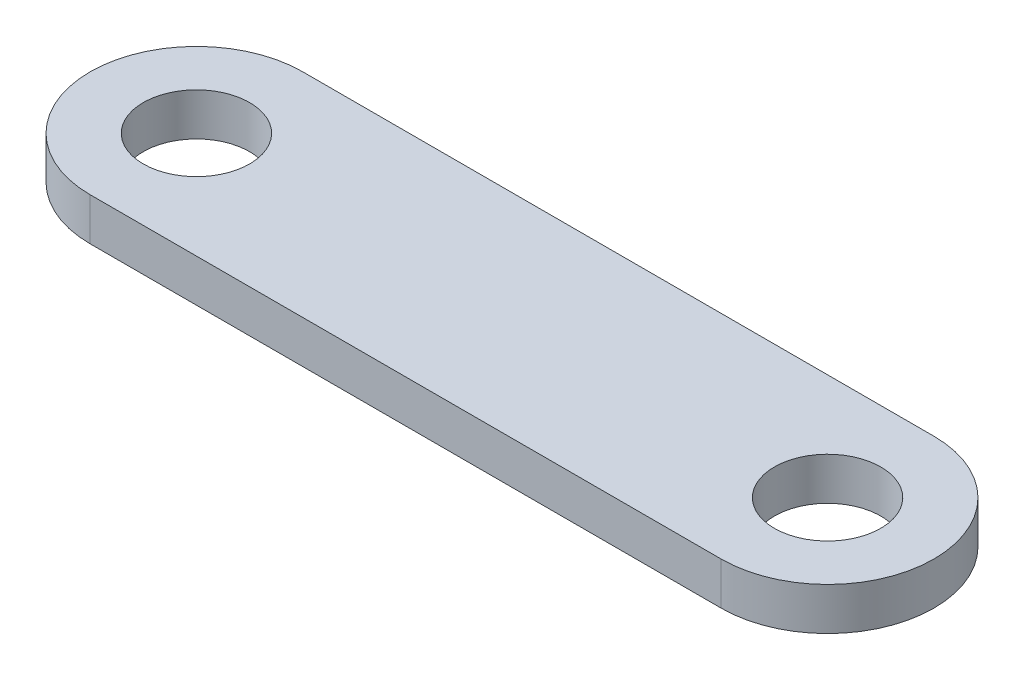
ISO-10303-21;
HEADER;
FILE_DESCRIPTION(('STEP AP214'),'2;1');
FILE_NAME('part.step','',(''),(''),'','','');
FILE_SCHEMA(('AUTOMOTIVE_DESIGN { 1 0 10303 214 1 1 1 1 }'));
ENDSEC;
DATA;
#1=APPLICATION_CONTEXT('core data for automotive mechanical design processes');
#2=APPLICATION_PROTOCOL_DEFINITION('international standard','automotive_design',2000,#1);
#3=PRODUCT_CONTEXT('',#1,'mechanical');
#4=PRODUCT('Part','Part','',(#3));
#5=PRODUCT_RELATED_PRODUCT_CATEGORY('part','',(#4));
#6=PRODUCT_DEFINITION_FORMATION('','',#4);
#7=PRODUCT_DEFINITION_CONTEXT('part definition',#1,'design');
#8=PRODUCT_DEFINITION('design','',#6,#7);
#9=PRODUCT_DEFINITION_SHAPE('','',#8);
#10=(LENGTH_UNIT() NAMED_UNIT(*) SI_UNIT(.MILLI.,.METRE.));
#11=(NAMED_UNIT(*) PLANE_ANGLE_UNIT() SI_UNIT($,.RADIAN.));
#12=(NAMED_UNIT(*) SI_UNIT($,.STERADIAN.) SOLID_ANGLE_UNIT());
#13=UNCERTAINTY_MEASURE_WITH_UNIT(LENGTH_MEASURE(1.E-05),#10,'distance_accuracy_value','');
#14=(GEOMETRIC_REPRESENTATION_CONTEXT(3) GLOBAL_UNCERTAINTY_ASSIGNED_CONTEXT((#13)) GLOBAL_UNIT_ASSIGNED_CONTEXT((#10,
#11,#12)) REPRESENTATION_CONTEXT('',''));
#15=CARTESIAN_POINT('',(0.,0.,0.));
#16=DIRECTION('',(0.,0.,1.));
#17=DIRECTION('',(1.,0.,0.));
#18=AXIS2_PLACEMENT_3D('',#15,#16,#17);
#19=CARTESIAN_POINT('',(-18.837656,2.54,0.));
#20=DIRECTION('',(0.,1.,0.));
#21=DIRECTION('',(0.,0.,1.));
#22=AXIS2_PLACEMENT_3D('',#19,#20,#21);
#23=PLANE('',#22);
#24=CARTESIAN_POINT('',(-18.837656,2.54,0.));
#25=DIRECTION('',(0.,1.,0.));
#26=DIRECTION('',(0.,0.,1.));
#27=AXIS2_PLACEMENT_3D('',#24,#25,#26);
#28=CIRCLE('',#27,3.175);
#29=CARTESIAN_POINT('',(-18.837656,2.54,3.175));
#30=VERTEX_POINT('',#29);
#31=EDGE_CURVE('E103',#30,#30,#28,.T.);
#32=ORIENTED_EDGE('',*,*,#31,.F.);
#33=EDGE_LOOP('',(#32));
#34=FACE_BOUND('',#33,.T.);
#35=CARTESIAN_POINT('',(-18.837656,2.54,0.));
#36=DIRECTION('',(0.,1.,0.));
#37=DIRECTION('',(0.,0.,1.));
#38=AXIS2_PLACEMENT_3D('',#35,#36,#37);
#39=CIRCLE('',#38,6.35);
#40=CARTESIAN_POINT('',(-18.837656,2.54,-6.35));
#41=VERTEX_POINT('',#40);
#42=CARTESIAN_POINT('',(-18.837656,2.54,6.35));
#43=VERTEX_POINT('',#42);
#44=EDGE_CURVE('E88',#41,#43,#39,.T.);
#45=ORIENTED_EDGE('',*,*,#44,.T.);
#46=DIRECTION('',(1.,0.,0.));
#47=VECTOR('',#46,1.);
#48=CARTESIAN_POINT('',(-18.837656,2.54,6.35));
#49=LINE('',#48,#47);
#50=CARTESIAN_POINT('',(18.837656,2.54,6.35));
#51=VERTEX_POINT('',#50);
#52=EDGE_CURVE('E83',#43,#51,#49,.T.);
#53=ORIENTED_EDGE('',*,*,#52,.T.);
#54=CARTESIAN_POINT('',(18.837656,2.54,0.));
#55=DIRECTION('',(0.,1.,0.));
#56=DIRECTION('',(0.,0.,1.));
#57=AXIS2_PLACEMENT_3D('',#54,#55,#56);
#58=CIRCLE('',#57,6.35);
#59=CARTESIAN_POINT('',(18.837656,2.54,-6.35));
#60=VERTEX_POINT('',#59);
#61=EDGE_CURVE('E86',#51,#60,#58,.T.);
#62=ORIENTED_EDGE('',*,*,#61,.T.);
#63=DIRECTION('',(-1.,0.,0.));
#64=VECTOR('',#63,1.);
#65=CARTESIAN_POINT('',(-18.837656,2.54,-6.35));
#66=LINE('',#65,#64);
#67=EDGE_CURVE('E53',#60,#41,#66,.T.);
#68=ORIENTED_EDGE('',*,*,#67,.T.);
#69=EDGE_LOOP('',(#45,#53,#62,#68));
#70=FACE_BOUND('',#69,.T.);
#71=CARTESIAN_POINT('',(18.837656,2.54,0.));
#72=DIRECTION('',(0.,1.,0.));
#73=DIRECTION('',(0.,0.,1.));
#74=AXIS2_PLACEMENT_3D('',#71,#72,#73);
#75=CIRCLE('',#74,3.175);
#76=CARTESIAN_POINT('',(18.837656,2.54,3.175));
#77=VERTEX_POINT('',#76);
#78=EDGE_CURVE('E118',#77,#77,#75,.T.);
#79=ORIENTED_EDGE('',*,*,#78,.F.);
#80=EDGE_LOOP('',(#79));
#81=FACE_BOUND('',#80,.T.);
#82=ADVANCED_FACE('F36',(#34,#70,#81),#23,.T.);
#83=CARTESIAN_POINT('',(-18.837656,0.,0.));
#84=DIRECTION('',(0.,1.,0.));
#85=DIRECTION('',(0.,0.,1.));
#86=AXIS2_PLACEMENT_3D('',#83,#84,#85);
#87=PLANE('',#86);
#88=CARTESIAN_POINT('',(-18.837656,0.,0.));
#89=DIRECTION('',(0.,1.,0.));
#90=DIRECTION('',(0.,0.,1.));
#91=AXIS2_PLACEMENT_3D('',#88,#89,#90);
#92=CIRCLE('',#91,6.35);
#93=CARTESIAN_POINT('',(-18.837656,0.,-6.35));
#94=VERTEX_POINT('',#93);
#95=CARTESIAN_POINT('',(-18.837656,0.,6.35));
#96=VERTEX_POINT('',#95);
#97=EDGE_CURVE('E100',#94,#96,#92,.T.);
#98=ORIENTED_EDGE('',*,*,#97,.F.);
#99=DIRECTION('',(-1.,0.,0.));
#100=VECTOR('',#99,1.);
#101=CARTESIAN_POINT('',(-18.837656,0.,-6.35));
#102=LINE('',#101,#100);
#103=CARTESIAN_POINT('',(18.837656,0.,-6.35));
#104=VERTEX_POINT('',#103);
#105=EDGE_CURVE('E76',#104,#94,#102,.T.);
#106=ORIENTED_EDGE('',*,*,#105,.F.);
#107=CARTESIAN_POINT('',(18.837656,0.,0.));
#108=DIRECTION('',(0.,1.,0.));
#109=DIRECTION('',(0.,0.,1.));
#110=AXIS2_PLACEMENT_3D('',#107,#108,#109);
#111=CIRCLE('',#110,6.35);
#112=CARTESIAN_POINT('',(18.837656,0.,6.35));
#113=VERTEX_POINT('',#112);
#114=EDGE_CURVE('E70',#113,#104,#111,.T.);
#115=ORIENTED_EDGE('',*,*,#114,.F.);
#116=DIRECTION('',(1.,0.,0.));
#117=VECTOR('',#116,1.);
#118=CARTESIAN_POINT('',(-18.837656,0.,6.35));
#119=LINE('',#118,#117);
#120=EDGE_CURVE('E92',#96,#113,#119,.T.);
#121=ORIENTED_EDGE('',*,*,#120,.F.);
#122=EDGE_LOOP('',(#98,#106,#115,#121));
#123=FACE_BOUND('',#122,.T.);
#124=CARTESIAN_POINT('',(-18.837656,0.,0.));
#125=DIRECTION('',(0.,1.,0.));
#126=DIRECTION('',(0.,0.,1.));
#127=AXIS2_PLACEMENT_3D('',#124,#125,#126);
#128=CIRCLE('',#127,3.175);
#129=CARTESIAN_POINT('',(-18.837656,0.,3.175));
#130=VERTEX_POINT('',#129);
#131=EDGE_CURVE('E115',#130,#130,#128,.T.);
#132=ORIENTED_EDGE('',*,*,#131,.T.);
#133=EDGE_LOOP('',(#132));
#134=FACE_BOUND('',#133,.T.);
#135=CARTESIAN_POINT('',(18.837656,0.,0.));
#136=DIRECTION('',(0.,1.,0.));
#137=DIRECTION('',(0.,0.,1.));
#138=AXIS2_PLACEMENT_3D('',#135,#136,#137);
#139=CIRCLE('',#138,3.175);
#140=CARTESIAN_POINT('',(18.837656,0.,3.175));
#141=VERTEX_POINT('',#140);
#142=EDGE_CURVE('E121',#141,#141,#139,.T.);
#143=ORIENTED_EDGE('',*,*,#142,.T.);
#144=EDGE_LOOP('',(#143));
#145=FACE_BOUND('',#144,.T.);
#146=ADVANCED_FACE('F111',(#123,#134,#145),#87,.F.);
#147=CARTESIAN_POINT('',(-18.837656,2.54,0.));
#148=DIRECTION('',(0.,-1.,0.));
#149=DIRECTION('',(0.,0.,-1.));
#150=AXIS2_PLACEMENT_3D('',#147,#148,#149);
#151=CYLINDRICAL_SURFACE('',#150,6.35);
#152=ORIENTED_EDGE('',*,*,#97,.T.);
#153=DIRECTION('',(0.,-1.,0.));
#154=VECTOR('',#153,1.);
#155=CARTESIAN_POINT('',(-18.837656,2.54,6.35));
#156=LINE('',#155,#154);
#157=EDGE_CURVE('E11',#43,#96,#156,.T.);
#158=ORIENTED_EDGE('',*,*,#157,.F.);
#159=ORIENTED_EDGE('',*,*,#44,.F.);
#160=DIRECTION('',(0.,-1.,0.));
#161=VECTOR('',#160,1.);
#162=CARTESIAN_POINT('',(-18.837656,2.54,-6.35));
#163=LINE('',#162,#161);
#164=EDGE_CURVE('E96',#41,#94,#163,.T.);
#165=ORIENTED_EDGE('',*,*,#164,.T.);
#166=EDGE_LOOP('',(#152,#158,#159,#165));
#167=FACE_BOUND('',#166,.T.);
#168=ADVANCED_FACE('F38',(#167),#151,.T.);
#169=CARTESIAN_POINT('',(-18.837656,2.54,6.35));
#170=DIRECTION('',(0.,0.,-1.));
#171=DIRECTION('',(-1.,0.,0.));
#172=AXIS2_PLACEMENT_3D('',#169,#170,#171);
#173=PLANE('',#172);
#174=ORIENTED_EDGE('',*,*,#120,.T.);
#175=DIRECTION('',(0.,-1.,0.));
#176=VECTOR('',#175,1.);
#177=CARTESIAN_POINT('',(18.837656,2.54,6.35));
#178=LINE('',#177,#176);
#179=EDGE_CURVE('E45',#51,#113,#178,.T.);
#180=ORIENTED_EDGE('',*,*,#179,.F.);
#181=ORIENTED_EDGE('',*,*,#52,.F.);
#182=ORIENTED_EDGE('',*,*,#157,.T.);
#183=EDGE_LOOP('',(#174,#180,#181,#182));
#184=FACE_BOUND('',#183,.T.);
#185=ADVANCED_FACE('F91',(#184),#173,.F.);
#186=CARTESIAN_POINT('',(18.837656,2.54,0.));
#187=DIRECTION('',(0.,-1.,0.));
#188=DIRECTION('',(0.,0.,-1.));
#189=AXIS2_PLACEMENT_3D('',#186,#187,#188);
#190=CYLINDRICAL_SURFACE('',#189,6.35);
#191=ORIENTED_EDGE('',*,*,#114,.T.);
#192=DIRECTION('',(0.,-1.,0.));
#193=VECTOR('',#192,1.);
#194=CARTESIAN_POINT('',(18.837656,2.54,-6.35));
#195=LINE('',#194,#193);
#196=EDGE_CURVE('E93',#60,#104,#195,.T.);
#197=ORIENTED_EDGE('',*,*,#196,.F.);
#198=ORIENTED_EDGE('',*,*,#61,.F.);
#199=ORIENTED_EDGE('',*,*,#179,.T.);
#200=EDGE_LOOP('',(#191,#197,#198,#199));
#201=FACE_BOUND('',#200,.T.);
#202=ADVANCED_FACE('F94',(#201),#190,.T.);
#203=CARTESIAN_POINT('',(-18.837656,2.54,-6.35));
#204=DIRECTION('',(0.,0.,1.));
#205=DIRECTION('',(1.,0.,0.));
#206=AXIS2_PLACEMENT_3D('',#203,#204,#205);
#207=PLANE('',#206);
#208=ORIENTED_EDGE('',*,*,#105,.T.);
#209=ORIENTED_EDGE('',*,*,#164,.F.);
#210=ORIENTED_EDGE('',*,*,#67,.F.);
#211=ORIENTED_EDGE('',*,*,#196,.T.);
#212=EDGE_LOOP('',(#208,#209,#210,#211));
#213=FACE_BOUND('',#212,.T.);
#214=ADVANCED_FACE('F108',(#213),#207,.F.);
#215=CARTESIAN_POINT('',(-18.837656,2.54,0.));
#216=DIRECTION('',(0.,-1.,0.));
#217=DIRECTION('',(0.,0.,-1.));
#218=AXIS2_PLACEMENT_3D('',#215,#216,#217);
#219=CYLINDRICAL_SURFACE('',#218,3.175);
#220=ORIENTED_EDGE('',*,*,#31,.T.);
#221=EDGE_LOOP('',(#220));
#222=FACE_BOUND('',#221,.T.);
#223=ORIENTED_EDGE('',*,*,#131,.F.);
#224=EDGE_LOOP('',(#223));
#225=FACE_BOUND('',#224,.T.);
#226=ADVANCED_FACE('F138',(#222,#225),#219,.F.);
#227=CARTESIAN_POINT('',(18.837656,2.54,0.));
#228=DIRECTION('',(0.,-1.,0.));
#229=DIRECTION('',(0.,0.,-1.));
#230=AXIS2_PLACEMENT_3D('',#227,#228,#229);
#231=CYLINDRICAL_SURFACE('',#230,3.175);
#232=ORIENTED_EDGE('',*,*,#78,.T.);
#233=EDGE_LOOP('',(#232));
#234=FACE_BOUND('',#233,.T.);
#235=ORIENTED_EDGE('',*,*,#142,.F.);
#236=EDGE_LOOP('',(#235));
#237=FACE_BOUND('',#236,.T.);
#238=ADVANCED_FACE('F127',(#234,#237),#231,.F.);
#239=CLOSED_SHELL('',(#82,#146,#168,#185,#202,#214,#226,#238));
#240=MANIFOLD_SOLID_BREP('B2',#239);
#241=ADVANCED_BREP_SHAPE_REPRESENTATION('',(#18,#240),#14);
#242=SHAPE_DEFINITION_REPRESENTATION(#9,#241);
ENDSEC;
END-ISO-10303-21;
